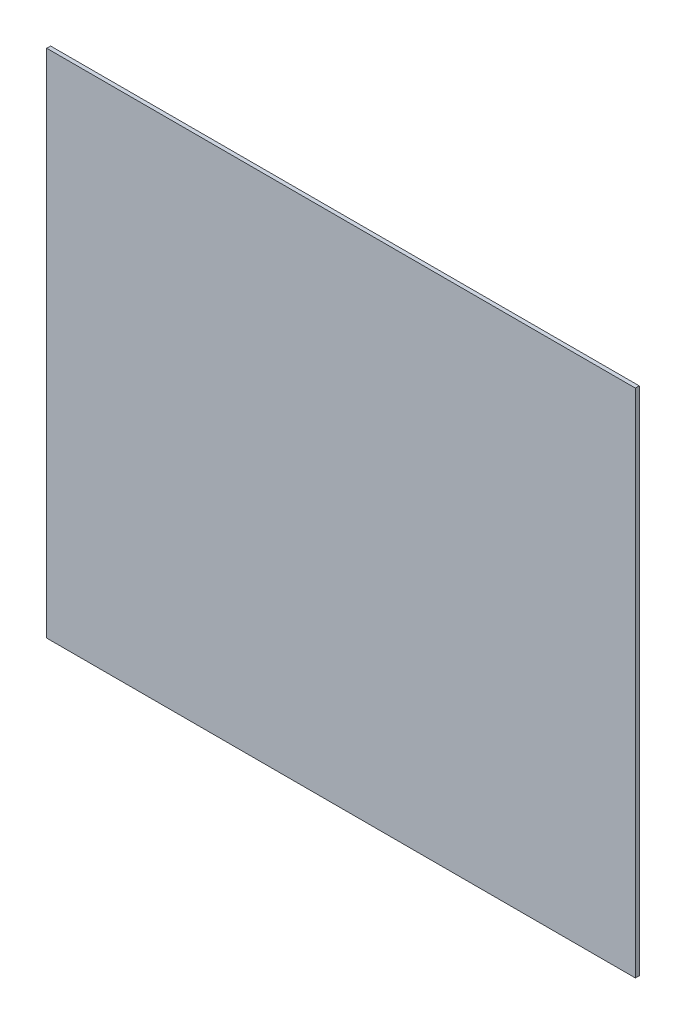
ISO-10303-21;
HEADER;
FILE_DESCRIPTION(('STEP AP214'),'2;1');
FILE_NAME('part.step','',(''),(''),'','','');
FILE_SCHEMA(('AUTOMOTIVE_DESIGN { 1 0 10303 214 1 1 1 1 }'));
ENDSEC;
DATA;
#1=APPLICATION_CONTEXT('core data for automotive mechanical design processes');
#2=APPLICATION_PROTOCOL_DEFINITION('international standard','automotive_design',2000,#1);
#3=PRODUCT_CONTEXT('',#1,'mechanical');
#4=PRODUCT('Part','Part','',(#3));
#5=PRODUCT_RELATED_PRODUCT_CATEGORY('part','',(#4));
#6=PRODUCT_DEFINITION_FORMATION('','',#4);
#7=PRODUCT_DEFINITION_CONTEXT('part definition',#1,'design');
#8=PRODUCT_DEFINITION('design','',#6,#7);
#9=PRODUCT_DEFINITION_SHAPE('','',#8);
#10=(LENGTH_UNIT() NAMED_UNIT(*) SI_UNIT(.MILLI.,.METRE.));
#11=(NAMED_UNIT(*) PLANE_ANGLE_UNIT() SI_UNIT($,.RADIAN.));
#12=(NAMED_UNIT(*) SI_UNIT($,.STERADIAN.) SOLID_ANGLE_UNIT());
#13=UNCERTAINTY_MEASURE_WITH_UNIT(LENGTH_MEASURE(1.E-05),#10,'distance_accuracy_value','');
#14=(GEOMETRIC_REPRESENTATION_CONTEXT(3) GLOBAL_UNCERTAINTY_ASSIGNED_CONTEXT((#13)) GLOBAL_UNIT_ASSIGNED_CONTEXT((#10,
#11,#12)) REPRESENTATION_CONTEXT('',''));
#15=CARTESIAN_POINT('',(0.,0.,0.));
#16=DIRECTION('',(0.,0.,1.));
#17=DIRECTION('',(1.,0.,0.));
#18=AXIS2_PLACEMENT_3D('',#15,#16,#17);
#19=CARTESIAN_POINT('',(227.,197.,0.));
#20=DIRECTION('',(0.,0.,1.));
#21=DIRECTION('',(1.,0.,0.));
#22=AXIS2_PLACEMENT_3D('',#19,#20,#21);
#23=PLANE('',#22);
#24=DIRECTION('',(0.,1.,0.));
#25=VECTOR('',#24,1.);
#26=CARTESIAN_POINT('',(0.,394.,0.));
#27=LINE('',#26,#25);
#28=CARTESIAN_POINT('',(0.,394.,0.));
#29=VERTEX_POINT('',#28);
#30=CARTESIAN_POINT('',(0.,0.,0.));
#31=VERTEX_POINT('',#30);
#32=EDGE_CURVE('E87',#29,#31,#27,.F.);
#33=ORIENTED_EDGE('',*,*,#32,.F.);
#34=DIRECTION('',(1.,0.,0.));
#35=VECTOR('',#34,1.);
#36=CARTESIAN_POINT('',(454.,394.,0.));
#37=LINE('',#36,#35);
#38=CARTESIAN_POINT('',(454.,394.,0.));
#39=VERTEX_POINT('',#38);
#40=EDGE_CURVE('E56',#39,#29,#37,.F.);
#41=ORIENTED_EDGE('',*,*,#40,.F.);
#42=DIRECTION('',(0.,1.,0.));
#43=VECTOR('',#42,1.);
#44=CARTESIAN_POINT('',(454.,0.,0.));
#45=LINE('',#44,#43);
#46=CARTESIAN_POINT('',(454.,0.,0.));
#47=VERTEX_POINT('',#46);
#48=EDGE_CURVE('E58',#47,#39,#45,.T.);
#49=ORIENTED_EDGE('',*,*,#48,.F.);
#50=DIRECTION('',(1.,0.,0.));
#51=VECTOR('',#50,1.);
#52=CARTESIAN_POINT('',(0.,0.,0.));
#53=LINE('',#52,#51);
#54=EDGE_CURVE('E20',#31,#47,#53,.T.);
#55=ORIENTED_EDGE('',*,*,#54,.F.);
#56=EDGE_LOOP('',(#33,#41,#49,#55));
#57=FACE_BOUND('',#56,.T.);
#58=ADVANCED_FACE('F17',(#57),#23,.F.);
#59=CARTESIAN_POINT('',(0.,0.,0.));
#60=DIRECTION('',(0.,-1.,0.));
#61=DIRECTION('',(0.,0.,-1.));
#62=AXIS2_PLACEMENT_3D('',#59,#60,#61);
#63=PLANE('',#62);
#64=DIRECTION('',(1.,0.,0.));
#65=VECTOR('',#64,1.);
#66=CARTESIAN_POINT('',(227.,0.,3.));
#67=LINE('',#66,#65);
#68=CARTESIAN_POINT('',(0.,0.,3.));
#69=VERTEX_POINT('',#68);
#70=CARTESIAN_POINT('',(454.,0.,3.));
#71=VERTEX_POINT('',#70);
#72=EDGE_CURVE('E93',#69,#71,#67,.T.);
#73=ORIENTED_EDGE('',*,*,#72,.F.);
#74=DIRECTION('',(0.,0.,1.));
#75=VECTOR('',#74,1.);
#76=CARTESIAN_POINT('',(0.,0.,0.));
#77=LINE('',#76,#75);
#78=EDGE_CURVE('E70',#31,#69,#77,.T.);
#79=ORIENTED_EDGE('',*,*,#78,.F.);
#80=ORIENTED_EDGE('',*,*,#54,.T.);
#81=DIRECTION('',(0.,0.,-1.));
#82=VECTOR('',#81,1.);
#83=CARTESIAN_POINT('',(454.,0.,0.));
#84=LINE('',#83,#82);
#85=EDGE_CURVE('E65',#71,#47,#84,.T.);
#86=ORIENTED_EDGE('',*,*,#85,.F.);
#87=EDGE_LOOP('',(#73,#79,#80,#86));
#88=FACE_BOUND('',#87,.T.);
#89=ADVANCED_FACE('F67',(#88),#63,.T.);
#90=CARTESIAN_POINT('',(454.,0.,0.));
#91=DIRECTION('',(1.,0.,0.));
#92=DIRECTION('',(0.,0.,-1.));
#93=AXIS2_PLACEMENT_3D('',#90,#91,#92);
#94=PLANE('',#93);
#95=DIRECTION('',(0.,1.,0.));
#96=VECTOR('',#95,1.);
#97=CARTESIAN_POINT('',(454.,197.,3.));
#98=LINE('',#97,#96);
#99=CARTESIAN_POINT('',(454.,394.,3.));
#100=VERTEX_POINT('',#99);
#101=EDGE_CURVE('E75',#71,#100,#98,.T.);
#102=ORIENTED_EDGE('',*,*,#101,.F.);
#103=ORIENTED_EDGE('',*,*,#85,.T.);
#104=ORIENTED_EDGE('',*,*,#48,.T.);
#105=DIRECTION('',(0.,0.,1.));
#106=VECTOR('',#105,1.);
#107=CARTESIAN_POINT('',(454.,394.,0.));
#108=LINE('',#107,#106);
#109=EDGE_CURVE('E82',#100,#39,#108,.F.);
#110=ORIENTED_EDGE('',*,*,#109,.F.);
#111=EDGE_LOOP('',(#102,#103,#104,#110));
#112=FACE_BOUND('',#111,.T.);
#113=ADVANCED_FACE('F73',(#112),#94,.T.);
#114=CARTESIAN_POINT('',(454.,394.,0.));
#115=DIRECTION('',(0.,1.,0.));
#116=DIRECTION('',(0.,0.,1.));
#117=AXIS2_PLACEMENT_3D('',#114,#115,#116);
#118=PLANE('',#117);
#119=DIRECTION('',(1.,0.,0.));
#120=VECTOR('',#119,1.);
#121=CARTESIAN_POINT('',(227.,394.,3.));
#122=LINE('',#121,#120);
#123=CARTESIAN_POINT('',(0.,394.,3.));
#124=VERTEX_POINT('',#123);
#125=EDGE_CURVE('E27',#100,#124,#122,.F.);
#126=ORIENTED_EDGE('',*,*,#125,.F.);
#127=ORIENTED_EDGE('',*,*,#109,.T.);
#128=ORIENTED_EDGE('',*,*,#40,.T.);
#129=DIRECTION('',(0.,0.,1.));
#130=VECTOR('',#129,1.);
#131=CARTESIAN_POINT('',(0.,394.,0.));
#132=LINE('',#131,#130);
#133=EDGE_CURVE('E36',#124,#29,#132,.F.);
#134=ORIENTED_EDGE('',*,*,#133,.F.);
#135=EDGE_LOOP('',(#126,#127,#128,#134));
#136=FACE_BOUND('',#135,.T.);
#137=ADVANCED_FACE('F102',(#136),#118,.T.);
#138=CARTESIAN_POINT('',(0.,394.,0.));
#139=DIRECTION('',(-1.,0.,0.));
#140=DIRECTION('',(0.,0.,1.));
#141=AXIS2_PLACEMENT_3D('',#138,#139,#140);
#142=PLANE('',#141);
#143=DIRECTION('',(0.,1.,0.));
#144=VECTOR('',#143,1.);
#145=CARTESIAN_POINT('',(0.,197.,3.));
#146=LINE('',#145,#144);
#147=EDGE_CURVE('E11',#124,#69,#146,.F.);
#148=ORIENTED_EDGE('',*,*,#147,.F.);
#149=ORIENTED_EDGE('',*,*,#133,.T.);
#150=ORIENTED_EDGE('',*,*,#32,.T.);
#151=ORIENTED_EDGE('',*,*,#78,.T.);
#152=EDGE_LOOP('',(#148,#149,#150,#151));
#153=FACE_BOUND('',#152,.T.);
#154=ADVANCED_FACE('F104',(#153),#142,.T.);
#155=CARTESIAN_POINT('',(227.,197.,3.));
#156=DIRECTION('',(0.,0.,1.));
#157=DIRECTION('',(1.,0.,0.));
#158=AXIS2_PLACEMENT_3D('',#155,#156,#157);
#159=PLANE('',#158);
#160=ORIENTED_EDGE('',*,*,#125,.T.);
#161=ORIENTED_EDGE('',*,*,#147,.T.);
#162=ORIENTED_EDGE('',*,*,#72,.T.);
#163=ORIENTED_EDGE('',*,*,#101,.T.);
#164=EDGE_LOOP('',(#160,#161,#162,#163));
#165=FACE_BOUND('',#164,.T.);
#166=ADVANCED_FACE('F101',(#165),#159,.T.);
#167=CLOSED_SHELL('',(#58,#89,#113,#137,#154,#166));
#168=MANIFOLD_SOLID_BREP('B1',#167);
#169=ADVANCED_BREP_SHAPE_REPRESENTATION('',(#18,#168),#14);
#170=SHAPE_DEFINITION_REPRESENTATION(#9,#169);
ENDSEC;
END-ISO-10303-21;
